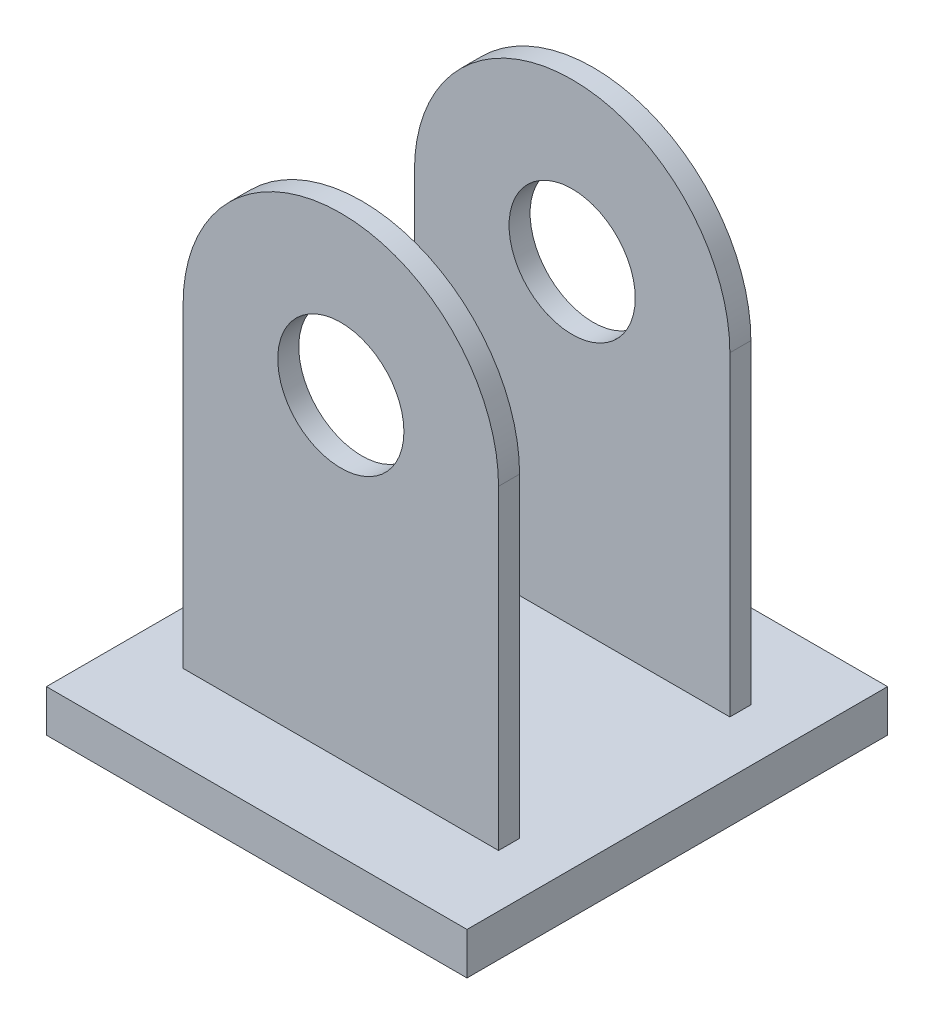
ISO-10303-21;
HEADER;
FILE_DESCRIPTION(('STEP AP214'),'2;1');
FILE_NAME('part.step','',(''),(''),'','','');
FILE_SCHEMA(('AUTOMOTIVE_DESIGN { 1 0 10303 214 1 1 1 1 }'));
ENDSEC;
DATA;
#1=APPLICATION_CONTEXT('core data for automotive mechanical design processes');
#2=APPLICATION_PROTOCOL_DEFINITION('international standard','automotive_design',2000,#1);
#3=PRODUCT_CONTEXT('',#1,'mechanical');
#4=PRODUCT('Part','Part','',(#3));
#5=PRODUCT_RELATED_PRODUCT_CATEGORY('part','',(#4));
#6=PRODUCT_DEFINITION_FORMATION('','',#4);
#7=PRODUCT_DEFINITION_CONTEXT('part definition',#1,'design');
#8=PRODUCT_DEFINITION('design','',#6,#7);
#9=PRODUCT_DEFINITION_SHAPE('','',#8);
#10=(LENGTH_UNIT() NAMED_UNIT(*) SI_UNIT(.MILLI.,.METRE.));
#11=(NAMED_UNIT(*) PLANE_ANGLE_UNIT() SI_UNIT($,.RADIAN.));
#12=(NAMED_UNIT(*) SI_UNIT($,.STERADIAN.) SOLID_ANGLE_UNIT());
#13=UNCERTAINTY_MEASURE_WITH_UNIT(LENGTH_MEASURE(1.E-05),#10,'distance_accuracy_value','');
#14=(GEOMETRIC_REPRESENTATION_CONTEXT(3) GLOBAL_UNCERTAINTY_ASSIGNED_CONTEXT((#13)) GLOBAL_UNIT_ASSIGNED_CONTEXT((#10,
#11,#12)) REPRESENTATION_CONTEXT('',''));
#15=CARTESIAN_POINT('',(0.,0.,0.));
#16=DIRECTION('',(0.,0.,1.));
#17=DIRECTION('',(1.,0.,0.));
#18=AXIS2_PLACEMENT_3D('',#15,#16,#17);
#19=CARTESIAN_POINT('',(0.,2.,0.));
#20=DIRECTION('',(0.,-1.,0.));
#21=DIRECTION('',(0.,0.,-1.));
#22=AXIS2_PLACEMENT_3D('',#19,#20,#21);
#23=PLANE('',#22);
#24=DIRECTION('',(0.,0.,-1.));
#25=VECTOR('',#24,1.);
#26=CARTESIAN_POINT('',(7.5,2.,6.));
#27=LINE('',#26,#25);
#28=CARTESIAN_POINT('',(7.5,2.,6.));
#29=VERTEX_POINT('',#28);
#30=CARTESIAN_POINT('',(7.5,2.,5.));
#31=VERTEX_POINT('',#30);
#32=EDGE_CURVE('E63',#29,#31,#27,.T.);
#33=ORIENTED_EDGE('',*,*,#32,.F.);
#34=DIRECTION('',(1.,0.,0.));
#35=VECTOR('',#34,1.);
#36=CARTESIAN_POINT('',(-7.5,2.,6.));
#37=LINE('',#36,#35);
#38=CARTESIAN_POINT('',(-7.5,2.,6.));
#39=VERTEX_POINT('',#38);
#40=EDGE_CURVE('E203',#39,#29,#37,.T.);
#41=ORIENTED_EDGE('',*,*,#40,.F.);
#42=DIRECTION('',(0.,0.,-1.));
#43=VECTOR('',#42,1.);
#44=CARTESIAN_POINT('',(-7.5,2.,6.));
#45=LINE('',#44,#43);
#46=CARTESIAN_POINT('',(-7.5,2.,5.));
#47=VERTEX_POINT('',#46);
#48=EDGE_CURVE('E220',#39,#47,#45,.T.);
#49=ORIENTED_EDGE('',*,*,#48,.T.);
#50=DIRECTION('',(1.,0.,0.));
#51=VECTOR('',#50,1.);
#52=CARTESIAN_POINT('',(-7.5,2.,5.));
#53=LINE('',#52,#51);
#54=EDGE_CURVE('E196',#47,#31,#53,.T.);
#55=ORIENTED_EDGE('',*,*,#54,.T.);
#56=EDGE_LOOP('',(#33,#41,#49,#55));
#57=FACE_BOUND('',#56,.T.);
#58=DIRECTION('',(0.,0.,-1.));
#59=VECTOR('',#58,1.);
#60=CARTESIAN_POINT('',(10.,2.,10.));
#61=LINE('',#60,#59);
#62=CARTESIAN_POINT('',(10.,2.,10.));
#63=VERTEX_POINT('',#62);
#64=CARTESIAN_POINT('',(10.,2.,-10.));
#65=VERTEX_POINT('',#64);
#66=EDGE_CURVE('E232',#63,#65,#61,.T.);
#67=ORIENTED_EDGE('',*,*,#66,.T.);
#68=DIRECTION('',(-1.,0.,0.));
#69=VECTOR('',#68,1.);
#70=CARTESIAN_POINT('',(-10.,2.,-10.));
#71=LINE('',#70,#69);
#72=CARTESIAN_POINT('',(-10.,2.,-10.));
#73=VERTEX_POINT('',#72);
#74=EDGE_CURVE('E236',#65,#73,#71,.T.);
#75=ORIENTED_EDGE('',*,*,#74,.T.);
#76=DIRECTION('',(0.,0.,1.));
#77=VECTOR('',#76,1.);
#78=CARTESIAN_POINT('',(-10.,2.,10.));
#79=LINE('',#78,#77);
#80=CARTESIAN_POINT('',(-10.,2.,10.));
#81=VERTEX_POINT('',#80);
#82=EDGE_CURVE('E240',#73,#81,#79,.T.);
#83=ORIENTED_EDGE('',*,*,#82,.T.);
#84=DIRECTION('',(1.,0.,0.));
#85=VECTOR('',#84,1.);
#86=CARTESIAN_POINT('',(-10.,2.,10.));
#87=LINE('',#86,#85);
#88=EDGE_CURVE('E243',#81,#63,#87,.T.);
#89=ORIENTED_EDGE('',*,*,#88,.T.);
#90=EDGE_LOOP('',(#67,#75,#83,#89));
#91=FACE_BOUND('',#90,.T.);
#92=DIRECTION('',(1.,0.,0.));
#93=VECTOR('',#92,1.);
#94=CARTESIAN_POINT('',(-7.5,2.,-6.));
#95=LINE('',#94,#93);
#96=CARTESIAN_POINT('',(-7.5,2.,-6.));
#97=VERTEX_POINT('',#96);
#98=CARTESIAN_POINT('',(7.5,2.,-6.));
#99=VERTEX_POINT('',#98);
#100=EDGE_CURVE('E148',#97,#99,#95,.T.);
#101=ORIENTED_EDGE('',*,*,#100,.T.);
#102=DIRECTION('',(0.,0.,1.));
#103=VECTOR('',#102,1.);
#104=CARTESIAN_POINT('',(7.5,2.,-6.));
#105=LINE('',#104,#103);
#106=CARTESIAN_POINT('',(7.5,2.,-5.));
#107=VERTEX_POINT('',#106);
#108=EDGE_CURVE('E131',#99,#107,#105,.T.);
#109=ORIENTED_EDGE('',*,*,#108,.T.);
#110=DIRECTION('',(1.,0.,0.));
#111=VECTOR('',#110,1.);
#112=CARTESIAN_POINT('',(-7.5,2.,-5.));
#113=LINE('',#112,#111);
#114=CARTESIAN_POINT('',(-7.5,2.,-5.));
#115=VERTEX_POINT('',#114);
#116=EDGE_CURVE('E168',#115,#107,#113,.T.);
#117=ORIENTED_EDGE('',*,*,#116,.F.);
#118=DIRECTION('',(0.,0.,1.));
#119=VECTOR('',#118,1.);
#120=CARTESIAN_POINT('',(-7.5,2.,-6.));
#121=LINE('',#120,#119);
#122=EDGE_CURVE('E143',#97,#115,#121,.T.);
#123=ORIENTED_EDGE('',*,*,#122,.F.);
#124=EDGE_LOOP('',(#101,#109,#117,#123));
#125=FACE_BOUND('',#124,.T.);
#126=ADVANCED_FACE('F39',(#57,#91,#125),#23,.F.);
#127=CARTESIAN_POINT('',(10.,2.,10.));
#128=DIRECTION('',(-1.,0.,0.));
#129=DIRECTION('',(0.,0.,1.));
#130=AXIS2_PLACEMENT_3D('',#127,#128,#129);
#131=PLANE('',#130);
#132=DIRECTION('',(0.,0.,-1.));
#133=VECTOR('',#132,1.);
#134=CARTESIAN_POINT('',(10.,0.,10.));
#135=LINE('',#134,#133);
#136=CARTESIAN_POINT('',(10.,0.,10.));
#137=VERTEX_POINT('',#136);
#138=CARTESIAN_POINT('',(10.,0.,-10.));
#139=VERTEX_POINT('',#138);
#140=EDGE_CURVE('E231',#137,#139,#135,.T.);
#141=ORIENTED_EDGE('',*,*,#140,.T.);
#142=DIRECTION('',(0.,-1.,0.));
#143=VECTOR('',#142,1.);
#144=CARTESIAN_POINT('',(10.,2.,-10.));
#145=LINE('',#144,#143);
#146=EDGE_CURVE('E11',#65,#139,#145,.T.);
#147=ORIENTED_EDGE('',*,*,#146,.F.);
#148=ORIENTED_EDGE('',*,*,#66,.F.);
#149=DIRECTION('',(0.,-1.,0.));
#150=VECTOR('',#149,1.);
#151=CARTESIAN_POINT('',(10.,2.,10.));
#152=LINE('',#151,#150);
#153=EDGE_CURVE('E246',#63,#137,#152,.T.);
#154=ORIENTED_EDGE('',*,*,#153,.T.);
#155=EDGE_LOOP('',(#141,#147,#148,#154));
#156=FACE_BOUND('',#155,.T.);
#157=ADVANCED_FACE('F41',(#156),#131,.F.);
#158=CARTESIAN_POINT('',(-10.,2.,-10.));
#159=DIRECTION('',(0.,0.,1.));
#160=DIRECTION('',(1.,0.,0.));
#161=AXIS2_PLACEMENT_3D('',#158,#159,#160);
#162=PLANE('',#161);
#163=DIRECTION('',(-1.,0.,0.));
#164=VECTOR('',#163,1.);
#165=CARTESIAN_POINT('',(-10.,0.,-10.));
#166=LINE('',#165,#164);
#167=CARTESIAN_POINT('',(-10.,0.,-10.));
#168=VERTEX_POINT('',#167);
#169=EDGE_CURVE('E250',#139,#168,#166,.T.);
#170=ORIENTED_EDGE('',*,*,#169,.T.);
#171=DIRECTION('',(0.,-1.,0.));
#172=VECTOR('',#171,1.);
#173=CARTESIAN_POINT('',(-10.,2.,-10.));
#174=LINE('',#173,#172);
#175=EDGE_CURVE('E48',#73,#168,#174,.T.);
#176=ORIENTED_EDGE('',*,*,#175,.F.);
#177=ORIENTED_EDGE('',*,*,#74,.F.);
#178=ORIENTED_EDGE('',*,*,#146,.T.);
#179=EDGE_LOOP('',(#170,#176,#177,#178));
#180=FACE_BOUND('',#179,.T.);
#181=ADVANCED_FACE('F285',(#180),#162,.F.);
#182=CARTESIAN_POINT('',(-10.,2.,10.));
#183=DIRECTION('',(1.,0.,0.));
#184=DIRECTION('',(0.,0.,-1.));
#185=AXIS2_PLACEMENT_3D('',#182,#183,#184);
#186=PLANE('',#185);
#187=DIRECTION('',(0.,0.,1.));
#188=VECTOR('',#187,1.);
#189=CARTESIAN_POINT('',(-10.,0.,10.));
#190=LINE('',#189,#188);
#191=CARTESIAN_POINT('',(-10.,0.,10.));
#192=VERTEX_POINT('',#191);
#193=EDGE_CURVE('E253',#168,#192,#190,.T.);
#194=ORIENTED_EDGE('',*,*,#193,.T.);
#195=DIRECTION('',(0.,-1.,0.));
#196=VECTOR('',#195,1.);
#197=CARTESIAN_POINT('',(-10.,2.,10.));
#198=LINE('',#197,#196);
#199=EDGE_CURVE('E261',#81,#192,#198,.T.);
#200=ORIENTED_EDGE('',*,*,#199,.F.);
#201=ORIENTED_EDGE('',*,*,#82,.F.);
#202=ORIENTED_EDGE('',*,*,#175,.T.);
#203=EDGE_LOOP('',(#194,#200,#201,#202));
#204=FACE_BOUND('',#203,.T.);
#205=ADVANCED_FACE('F270',(#204),#186,.F.);
#206=CARTESIAN_POINT('',(-10.,2.,10.));
#207=DIRECTION('',(0.,0.,-1.));
#208=DIRECTION('',(-1.,0.,0.));
#209=AXIS2_PLACEMENT_3D('',#206,#207,#208);
#210=PLANE('',#209);
#211=DIRECTION('',(1.,0.,0.));
#212=VECTOR('',#211,1.);
#213=CARTESIAN_POINT('',(-10.,0.,10.));
#214=LINE('',#213,#212);
#215=EDGE_CURVE('E237',#192,#137,#214,.T.);
#216=ORIENTED_EDGE('',*,*,#215,.T.);
#217=ORIENTED_EDGE('',*,*,#153,.F.);
#218=ORIENTED_EDGE('',*,*,#88,.F.);
#219=ORIENTED_EDGE('',*,*,#199,.T.);
#220=EDGE_LOOP('',(#216,#217,#218,#219));
#221=FACE_BOUND('',#220,.T.);
#222=ADVANCED_FACE('F279',(#221),#210,.F.);
#223=CARTESIAN_POINT('',(0.,0.,0.));
#224=DIRECTION('',(0.,-1.,0.));
#225=DIRECTION('',(0.,0.,-1.));
#226=AXIS2_PLACEMENT_3D('',#223,#224,#225);
#227=PLANE('',#226);
#228=ORIENTED_EDGE('',*,*,#140,.F.);
#229=ORIENTED_EDGE('',*,*,#215,.F.);
#230=ORIENTED_EDGE('',*,*,#193,.F.);
#231=ORIENTED_EDGE('',*,*,#169,.F.);
#232=EDGE_LOOP('',(#228,#229,#230,#231));
#233=FACE_BOUND('',#232,.T.);
#234=ADVANCED_FACE('F276',(#233),#227,.T.);
#235=CARTESIAN_POINT('',(0.,17.,6.));
#236=DIRECTION('',(0.,0.,-1.));
#237=DIRECTION('',(-1.,0.,0.));
#238=AXIS2_PLACEMENT_3D('',#235,#236,#237);
#239=PLANE('',#238);
#240=DIRECTION('',(0.,1.,0.));
#241=VECTOR('',#240,1.);
#242=CARTESIAN_POINT('',(7.5,17.,6.));
#243=LINE('',#242,#241);
#244=CARTESIAN_POINT('',(7.5,17.,6.));
#245=VERTEX_POINT('',#244);
#246=EDGE_CURVE('E191',#29,#245,#243,.T.);
#247=ORIENTED_EDGE('',*,*,#246,.T.);
#248=CARTESIAN_POINT('',(0.,17.,6.));
#249=DIRECTION('',(0.,0.,1.));
#250=DIRECTION('',(-1.,0.,0.));
#251=AXIS2_PLACEMENT_3D('',#248,#249,#250);
#252=CIRCLE('',#251,7.5);
#253=CARTESIAN_POINT('',(-7.5,17.,6.));
#254=VERTEX_POINT('',#253);
#255=EDGE_CURVE('E195',#245,#254,#252,.T.);
#256=ORIENTED_EDGE('',*,*,#255,.T.);
#257=DIRECTION('',(0.,-1.,0.));
#258=VECTOR('',#257,1.);
#259=CARTESIAN_POINT('',(-7.5,17.,6.));
#260=LINE('',#259,#258);
#261=EDGE_CURVE('E199',#254,#39,#260,.T.);
#262=ORIENTED_EDGE('',*,*,#261,.T.);
#263=ORIENTED_EDGE('',*,*,#40,.T.);
#264=EDGE_LOOP('',(#247,#256,#262,#263));
#265=FACE_BOUND('',#264,.T.);
#266=CARTESIAN_POINT('',(0.,17.,6.));
#267=DIRECTION('',(0.,0.,1.));
#268=DIRECTION('',(1.,0.,0.));
#269=AXIS2_PLACEMENT_3D('',#266,#267,#268);
#270=CIRCLE('',#269,3.);
#271=CARTESIAN_POINT('',(3.,17.,6.));
#272=VERTEX_POINT('',#271);
#273=EDGE_CURVE('E183',#272,#272,#270,.T.);
#274=ORIENTED_EDGE('',*,*,#273,.F.);
#275=EDGE_LOOP('',(#274));
#276=FACE_BOUND('',#275,.T.);
#277=ADVANCED_FACE('F302',(#265,#276),#239,.F.);
#278=CARTESIAN_POINT('',(0.,17.,5.));
#279=DIRECTION('',(0.,0.,-1.));
#280=DIRECTION('',(-1.,0.,0.));
#281=AXIS2_PLACEMENT_3D('',#278,#279,#280);
#282=PLANE('',#281);
#283=DIRECTION('',(0.,1.,0.));
#284=VECTOR('',#283,1.);
#285=CARTESIAN_POINT('',(7.5,17.,5.));
#286=LINE('',#285,#284);
#287=CARTESIAN_POINT('',(7.5,17.,5.));
#288=VERTEX_POINT('',#287);
#289=EDGE_CURVE('E187',#31,#288,#286,.T.);
#290=ORIENTED_EDGE('',*,*,#289,.F.);
#291=ORIENTED_EDGE('',*,*,#54,.F.);
#292=DIRECTION('',(0.,-1.,0.));
#293=VECTOR('',#292,1.);
#294=CARTESIAN_POINT('',(-7.5,17.,5.));
#295=LINE('',#294,#293);
#296=CARTESIAN_POINT('',(-7.5,17.,5.));
#297=VERTEX_POINT('',#296);
#298=EDGE_CURVE('E212',#297,#47,#295,.T.);
#299=ORIENTED_EDGE('',*,*,#298,.F.);
#300=CARTESIAN_POINT('',(0.,17.,5.));
#301=DIRECTION('',(0.,0.,1.));
#302=DIRECTION('',(-1.,0.,0.));
#303=AXIS2_PLACEMENT_3D('',#300,#301,#302);
#304=CIRCLE('',#303,7.5);
#305=EDGE_CURVE('E209',#288,#297,#304,.T.);
#306=ORIENTED_EDGE('',*,*,#305,.F.);
#307=EDGE_LOOP('',(#290,#291,#299,#306));
#308=FACE_BOUND('',#307,.T.);
#309=CARTESIAN_POINT('',(0.,17.,5.));
#310=DIRECTION('',(0.,0.,1.));
#311=DIRECTION('',(1.,0.,0.));
#312=AXIS2_PLACEMENT_3D('',#309,#310,#311);
#313=CIRCLE('',#312,3.);
#314=CARTESIAN_POINT('',(3.,17.,5.));
#315=VERTEX_POINT('',#314);
#316=EDGE_CURVE('E142',#315,#315,#313,.T.);
#317=ORIENTED_EDGE('',*,*,#316,.T.);
#318=EDGE_LOOP('',(#317));
#319=FACE_BOUND('',#318,.T.);
#320=ADVANCED_FACE('F318',(#308,#319),#282,.T.);
#321=CARTESIAN_POINT('',(7.5,17.,6.));
#322=DIRECTION('',(-1.,0.,0.));
#323=DIRECTION('',(0.,0.,1.));
#324=AXIS2_PLACEMENT_3D('',#321,#322,#323);
#325=PLANE('',#324);
#326=ORIENTED_EDGE('',*,*,#289,.T.);
#327=DIRECTION('',(0.,0.,-1.));
#328=VECTOR('',#327,1.);
#329=CARTESIAN_POINT('',(7.5,17.,6.));
#330=LINE('',#329,#328);
#331=EDGE_CURVE('E227',#245,#288,#330,.T.);
#332=ORIENTED_EDGE('',*,*,#331,.F.);
#333=ORIENTED_EDGE('',*,*,#246,.F.);
#334=ORIENTED_EDGE('',*,*,#32,.T.);
#335=EDGE_LOOP('',(#326,#332,#333,#334));
#336=FACE_BOUND('',#335,.T.);
#337=ADVANCED_FACE('F298',(#336),#325,.F.);
#338=CARTESIAN_POINT('',(0.,17.,6.));
#339=DIRECTION('',(0.,0.,-1.));
#340=DIRECTION('',(-1.,0.,0.));
#341=AXIS2_PLACEMENT_3D('',#338,#339,#340);
#342=CYLINDRICAL_SURFACE('',#341,7.5);
#343=ORIENTED_EDGE('',*,*,#305,.T.);
#344=DIRECTION('',(0.,0.,-1.));
#345=VECTOR('',#344,1.);
#346=CARTESIAN_POINT('',(-7.5,17.,6.));
#347=LINE('',#346,#345);
#348=EDGE_CURVE('E223',#254,#297,#347,.T.);
#349=ORIENTED_EDGE('',*,*,#348,.F.);
#350=ORIENTED_EDGE('',*,*,#255,.F.);
#351=ORIENTED_EDGE('',*,*,#331,.T.);
#352=EDGE_LOOP('',(#343,#349,#350,#351));
#353=FACE_BOUND('',#352,.T.);
#354=ADVANCED_FACE('F333',(#353),#342,.T.);
#355=CARTESIAN_POINT('',(-7.5,17.,6.));
#356=DIRECTION('',(1.,0.,0.));
#357=DIRECTION('',(0.,0.,-1.));
#358=AXIS2_PLACEMENT_3D('',#355,#356,#357);
#359=PLANE('',#358);
#360=ORIENTED_EDGE('',*,*,#298,.T.);
#361=ORIENTED_EDGE('',*,*,#48,.F.);
#362=ORIENTED_EDGE('',*,*,#261,.F.);
#363=ORIENTED_EDGE('',*,*,#348,.T.);
#364=EDGE_LOOP('',(#360,#361,#362,#363));
#365=FACE_BOUND('',#364,.T.);
#366=ADVANCED_FACE('F340',(#365),#359,.F.);
#367=CARTESIAN_POINT('',(0.,17.,6.));
#368=DIRECTION('',(0.,0.,-1.));
#369=DIRECTION('',(-1.,0.,0.));
#370=AXIS2_PLACEMENT_3D('',#367,#368,#369);
#371=CYLINDRICAL_SURFACE('',#370,3.);
#372=ORIENTED_EDGE('',*,*,#273,.T.);
#373=EDGE_LOOP('',(#372));
#374=FACE_BOUND('',#373,.T.);
#375=ORIENTED_EDGE('',*,*,#316,.F.);
#376=EDGE_LOOP('',(#375));
#377=FACE_BOUND('',#376,.T.);
#378=ADVANCED_FACE('F347',(#374,#377),#371,.F.);
#379=CARTESIAN_POINT('',(7.5,17.,-6.));
#380=DIRECTION('',(1.,0.,0.));
#381=DIRECTION('',(0.,0.,-1.));
#382=AXIS2_PLACEMENT_3D('',#379,#380,#381);
#383=PLANE('',#382);
#384=DIRECTION('',(0.,1.,0.));
#385=VECTOR('',#384,1.);
#386=CARTESIAN_POINT('',(7.5,17.,-5.));
#387=LINE('',#386,#385);
#388=CARTESIAN_POINT('',(7.5,17.,-5.));
#389=VERTEX_POINT('',#388);
#390=EDGE_CURVE('E137',#107,#389,#387,.T.);
#391=ORIENTED_EDGE('',*,*,#390,.F.);
#392=ORIENTED_EDGE('',*,*,#108,.F.);
#393=DIRECTION('',(0.,1.,0.));
#394=VECTOR('',#393,1.);
#395=CARTESIAN_POINT('',(7.5,17.,-6.));
#396=LINE('',#395,#394);
#397=CARTESIAN_POINT('',(7.5,17.,-6.));
#398=VERTEX_POINT('',#397);
#399=EDGE_CURVE('E134',#99,#398,#396,.T.);
#400=ORIENTED_EDGE('',*,*,#399,.T.);
#401=DIRECTION('',(0.,0.,1.));
#402=VECTOR('',#401,1.);
#403=CARTESIAN_POINT('',(7.5,17.,-6.));
#404=LINE('',#403,#402);
#405=EDGE_CURVE('E165',#398,#389,#404,.T.);
#406=ORIENTED_EDGE('',*,*,#405,.T.);
#407=EDGE_LOOP('',(#391,#392,#400,#406));
#408=FACE_BOUND('',#407,.T.);
#409=ADVANCED_FACE('F133',(#408),#383,.T.);
#410=CARTESIAN_POINT('',(-7.5,17.,-6.));
#411=DIRECTION('',(-1.,0.,0.));
#412=DIRECTION('',(0.,0.,1.));
#413=AXIS2_PLACEMENT_3D('',#410,#411,#412);
#414=PLANE('',#413);
#415=DIRECTION('',(0.,-1.,0.));
#416=VECTOR('',#415,1.);
#417=CARTESIAN_POINT('',(-7.5,17.,-5.));
#418=LINE('',#417,#416);
#419=CARTESIAN_POINT('',(-7.5,17.,-5.));
#420=VERTEX_POINT('',#419);
#421=EDGE_CURVE('E55',#420,#115,#418,.T.);
#422=ORIENTED_EDGE('',*,*,#421,.F.);
#423=DIRECTION('',(0.,0.,1.));
#424=VECTOR('',#423,1.);
#425=CARTESIAN_POINT('',(-7.5,17.,-6.));
#426=LINE('',#425,#424);
#427=CARTESIAN_POINT('',(-7.5,17.,-6.));
#428=VERTEX_POINT('',#427);
#429=EDGE_CURVE('E178',#428,#420,#426,.T.);
#430=ORIENTED_EDGE('',*,*,#429,.F.);
#431=DIRECTION('',(0.,-1.,0.));
#432=VECTOR('',#431,1.);
#433=CARTESIAN_POINT('',(-7.5,17.,-6.));
#434=LINE('',#433,#432);
#435=EDGE_CURVE('E157',#428,#97,#434,.T.);
#436=ORIENTED_EDGE('',*,*,#435,.T.);
#437=ORIENTED_EDGE('',*,*,#122,.T.);
#438=EDGE_LOOP('',(#422,#430,#436,#437));
#439=FACE_BOUND('',#438,.T.);
#440=ADVANCED_FACE('F362',(#439),#414,.T.);
#441=CARTESIAN_POINT('',(0.,17.,-6.));
#442=DIRECTION('',(0.,0.,1.));
#443=DIRECTION('',(1.,0.,0.));
#444=AXIS2_PLACEMENT_3D('',#441,#442,#443);
#445=CYLINDRICAL_SURFACE('',#444,7.5);
#446=CARTESIAN_POINT('',(0.,17.,-5.));
#447=DIRECTION('',(0.,0.,1.));
#448=DIRECTION('',(-1.,0.,0.));
#449=AXIS2_PLACEMENT_3D('',#446,#447,#448);
#450=CIRCLE('',#449,7.5);
#451=EDGE_CURVE('E153',#389,#420,#450,.T.);
#452=ORIENTED_EDGE('',*,*,#451,.F.);
#453=ORIENTED_EDGE('',*,*,#405,.F.);
#454=CARTESIAN_POINT('',(0.,17.,-6.));
#455=DIRECTION('',(0.,0.,1.));
#456=DIRECTION('',(-1.,0.,0.));
#457=AXIS2_PLACEMENT_3D('',#454,#455,#456);
#458=CIRCLE('',#457,7.5);
#459=EDGE_CURVE('E151',#398,#428,#458,.T.);
#460=ORIENTED_EDGE('',*,*,#459,.T.);
#461=ORIENTED_EDGE('',*,*,#429,.T.);
#462=EDGE_LOOP('',(#452,#453,#460,#461));
#463=FACE_BOUND('',#462,.T.);
#464=ADVANCED_FACE('F369',(#463),#445,.T.);
#465=CARTESIAN_POINT('',(0.,17.,-6.));
#466=DIRECTION('',(0.,0.,1.));
#467=DIRECTION('',(-1.,0.,0.));
#468=AXIS2_PLACEMENT_3D('',#465,#466,#467);
#469=PLANE('',#468);
#470=CARTESIAN_POINT('',(0.,17.,-6.));
#471=DIRECTION('',(0.,0.,1.));
#472=DIRECTION('',(1.,0.,0.));
#473=AXIS2_PLACEMENT_3D('',#470,#471,#472);
#474=CIRCLE('',#473,3.);
#475=CARTESIAN_POINT('',(3.,17.,-6.));
#476=VERTEX_POINT('',#475);
#477=EDGE_CURVE('E169',#476,#476,#474,.T.);
#478=ORIENTED_EDGE('',*,*,#477,.T.);
#479=EDGE_LOOP('',(#478));
#480=FACE_BOUND('',#479,.T.);
#481=ORIENTED_EDGE('',*,*,#399,.F.);
#482=ORIENTED_EDGE('',*,*,#100,.F.);
#483=ORIENTED_EDGE('',*,*,#435,.F.);
#484=ORIENTED_EDGE('',*,*,#459,.F.);
#485=EDGE_LOOP('',(#481,#482,#483,#484));
#486=FACE_BOUND('',#485,.T.);
#487=ADVANCED_FACE('F146',(#480,#486),#469,.F.);
#488=CARTESIAN_POINT('',(0.,17.,-5.));
#489=DIRECTION('',(0.,0.,1.));
#490=DIRECTION('',(-1.,0.,0.));
#491=AXIS2_PLACEMENT_3D('',#488,#489,#490);
#492=PLANE('',#491);
#493=CARTESIAN_POINT('',(0.,17.,-5.));
#494=DIRECTION('',(0.,0.,1.));
#495=DIRECTION('',(1.,0.,0.));
#496=AXIS2_PLACEMENT_3D('',#493,#494,#495);
#497=CIRCLE('',#496,3.);
#498=CARTESIAN_POINT('',(3.,17.,-5.));
#499=VERTEX_POINT('',#498);
#500=EDGE_CURVE('E454',#499,#499,#497,.T.);
#501=ORIENTED_EDGE('',*,*,#500,.F.);
#502=EDGE_LOOP('',(#501));
#503=FACE_BOUND('',#502,.T.);
#504=ORIENTED_EDGE('',*,*,#390,.T.);
#505=ORIENTED_EDGE('',*,*,#451,.T.);
#506=ORIENTED_EDGE('',*,*,#421,.T.);
#507=ORIENTED_EDGE('',*,*,#116,.T.);
#508=EDGE_LOOP('',(#504,#505,#506,#507));
#509=FACE_BOUND('',#508,.T.);
#510=ADVANCED_FACE('F384',(#503,#509),#492,.T.);
#511=CARTESIAN_POINT('',(0.,17.,-6.));
#512=DIRECTION('',(0.,0.,1.));
#513=DIRECTION('',(1.,0.,0.));
#514=AXIS2_PLACEMENT_3D('',#511,#512,#513);
#515=CYLINDRICAL_SURFACE('',#514,3.);
#516=ORIENTED_EDGE('',*,*,#477,.F.);
#517=EDGE_LOOP('',(#516));
#518=FACE_BOUND('',#517,.T.);
#519=ORIENTED_EDGE('',*,*,#500,.T.);
#520=EDGE_LOOP('',(#519));
#521=FACE_BOUND('',#520,.T.);
#522=ADVANCED_FACE('F392',(#518,#521),#515,.F.);
#523=CLOSED_SHELL('',(#126,#157,#181,#205,#222,#234,#277,#320,#337,#354,#366,#378,#409,#440,
#464,#487,#510,#522));
#524=MANIFOLD_SOLID_BREP('B2',#523);
#525=ADVANCED_BREP_SHAPE_REPRESENTATION('',(#18,#524),#14);
#526=SHAPE_DEFINITION_REPRESENTATION(#9,#525);
ENDSEC;
END-ISO-10303-21;
